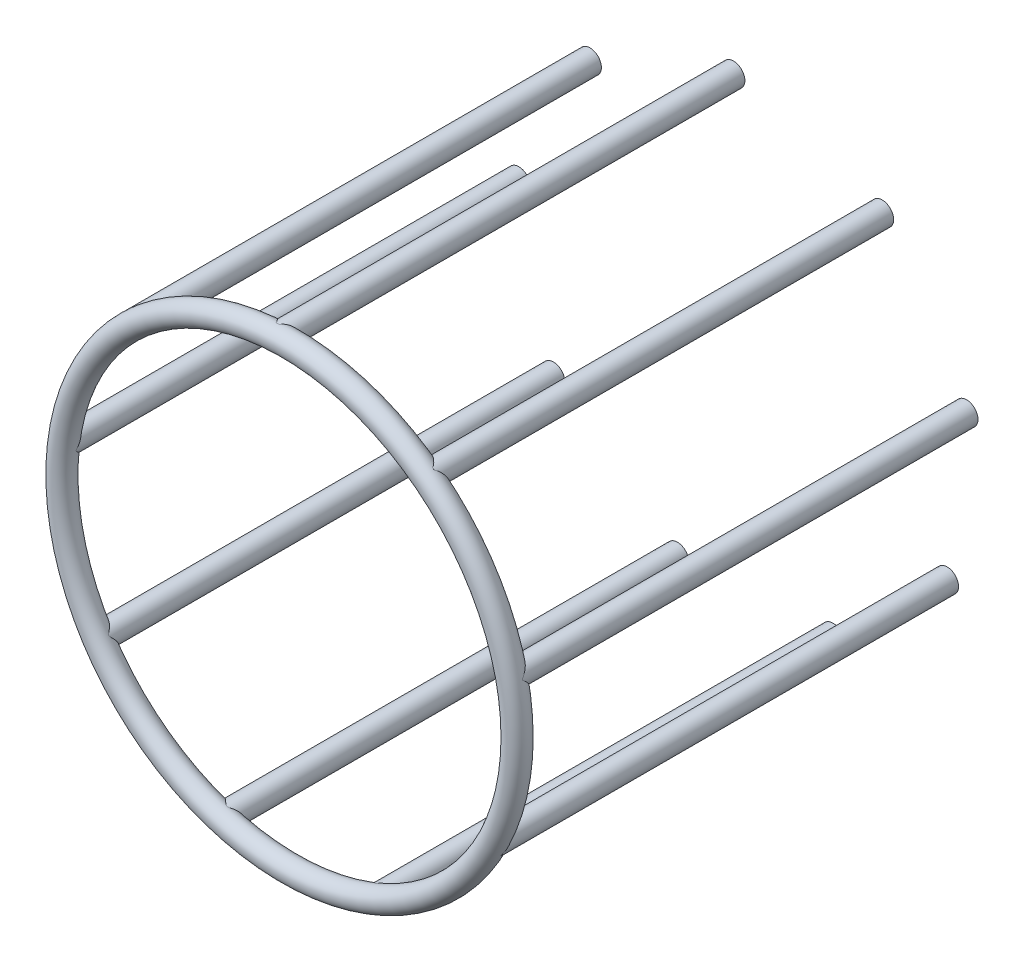
ISO-10303-21;
HEADER;
FILE_DESCRIPTION(('STEP AP214'),'2;1');
FILE_NAME('part.step','',(''),(''),'','','');
FILE_SCHEMA(('AUTOMOTIVE_DESIGN { 1 0 10303 214 1 1 1 1 }'));
ENDSEC;
DATA;
#1=APPLICATION_CONTEXT('core data for automotive mechanical design processes');
#2=APPLICATION_PROTOCOL_DEFINITION('international standard','automotive_design',2000,#1);
#3=PRODUCT_CONTEXT('',#1,'mechanical');
#4=PRODUCT('Part','Part','',(#3));
#5=PRODUCT_RELATED_PRODUCT_CATEGORY('part','',(#4));
#6=PRODUCT_DEFINITION_FORMATION('','',#4);
#7=PRODUCT_DEFINITION_CONTEXT('part definition',#1,'design');
#8=PRODUCT_DEFINITION('design','',#6,#7);
#9=PRODUCT_DEFINITION_SHAPE('','',#8);
#10=(LENGTH_UNIT() NAMED_UNIT(*) SI_UNIT(.MILLI.,.METRE.));
#11=(NAMED_UNIT(*) PLANE_ANGLE_UNIT() SI_UNIT($,.RADIAN.));
#12=(NAMED_UNIT(*) SI_UNIT($,.STERADIAN.) SOLID_ANGLE_UNIT());
#13=UNCERTAINTY_MEASURE_WITH_UNIT(LENGTH_MEASURE(1.E-05),#10,'distance_accuracy_value','');
#14=(GEOMETRIC_REPRESENTATION_CONTEXT(3) GLOBAL_UNCERTAINTY_ASSIGNED_CONTEXT((#13)) GLOBAL_UNIT_ASSIGNED_CONTEXT((#10,
#11,#12)) REPRESENTATION_CONTEXT('',''));
#15=CARTESIAN_POINT('',(0.,0.,0.));
#16=DIRECTION('',(0.,0.,1.));
#17=DIRECTION('',(1.,0.,0.));
#18=AXIS2_PLACEMENT_3D('',#15,#16,#17);
#19=CARTESIAN_POINT('',(0.,0.,100.));
#20=DIRECTION('',(0.,0.,1.));
#21=DIRECTION('',(1.,0.,0.));
#22=AXIS2_PLACEMENT_3D('',#19,#20,#21);
#23=TOROIDAL_SURFACE('',#22,50.,2.5);
#24=CARTESIAN_POINT('',(50.,0.,100.));
#25=DIRECTION('',(0.,1.,0.));
#26=DIRECTION('',(-1.,0.,0.));
#27=AXIS2_PLACEMENT_3D('',#24,#25,#26);
#28=CIRCLE('',#27,2.5);
#29=CARTESIAN_POINT('',(52.5,0.,100.));
#30=VERTEX_POINT('',#29);
#31=EDGE_CURVE('E12',#30,#30,#28,.T.);
#32=CARTESIAN_POINT('',(0.,0.,100.));
#33=DIRECTION('',(0.,0.,1.));
#34=DIRECTION('',(1.,0.,0.));
#35=AXIS2_PLACEMENT_3D('',#32,#33,#34);
#36=CIRCLE('',#35,52.5);
#37=EDGE_CURVE('',#30,#30,#36,.T.);
#38=ORIENTED_EDGE('',*,*,#31,.T.);
#39=ORIENTED_EDGE('',*,*,#31,.F.);
#40=ORIENTED_EDGE('',*,*,#37,.T.);
#41=ORIENTED_EDGE('',*,*,#37,.F.);
#42=EDGE_LOOP('',(#38,#40,#39,#41));
#43=FACE_BOUND('',#42,.T.);
#44=ADVANCED_FACE('F56',(#43),#23,.T.);
#45=CLOSED_SHELL('',(#44));
#46=MANIFOLD_SOLID_BREP('B2',#45);
#47=CARTESIAN_POINT('',(-49.6078099092593,6.2502156768226,100.));
#48=DIRECTION('',(0.,0.,-1.));
#49=DIRECTION('',(-1.,0.,0.));
#50=AXIS2_PLACEMENT_3D('',#47,#48,#49);
#51=CYLINDRICAL_SURFACE('',#50,2.5);
#52=CARTESIAN_POINT('',(-49.6078099092593,6.2502156768226,100.));
#53=DIRECTION('',(0.,0.,1.));
#54=DIRECTION('',(1.,0.,0.));
#55=AXIS2_PLACEMENT_3D('',#52,#53,#54);
#56=CIRCLE('',#55,2.5);
#57=CARTESIAN_POINT('',(-47.1078099092593,6.2502156768226,100.));
#58=VERTEX_POINT('',#57);
#59=EDGE_CURVE('E55',#58,#58,#56,.T.);
#60=ORIENTED_EDGE('',*,*,#59,.F.);
#61=EDGE_LOOP('',(#60));
#62=FACE_BOUND('',#61,.T.);
#63=CARTESIAN_POINT('',(-49.6078099092593,6.2502156768226,0.));
#64=DIRECTION('',(0.,0.,1.));
#65=DIRECTION('',(1.,0.,0.));
#66=AXIS2_PLACEMENT_3D('',#63,#64,#65);
#67=CIRCLE('',#66,2.5);
#68=CARTESIAN_POINT('',(-47.1078099092593,6.2502156768226,0.));
#69=VERTEX_POINT('',#68);
#70=EDGE_CURVE('E85',#69,#69,#67,.T.);
#71=ORIENTED_EDGE('',*,*,#70,.T.);
#72=EDGE_LOOP('',(#71));
#73=FACE_BOUND('',#72,.T.);
#74=ADVANCED_FACE('F82',(#62,#73),#51,.T.);
#75=CARTESIAN_POINT('',(-49.6078099092593,6.2502156768226,100.));
#76=DIRECTION('',(0.,0.,1.));
#77=DIRECTION('',(1.,0.,0.));
#78=AXIS2_PLACEMENT_3D('',#75,#76,#77);
#79=PLANE('',#78);
#80=ORIENTED_EDGE('',*,*,#59,.T.);
#81=EDGE_LOOP('',(#80));
#82=FACE_BOUND('',#81,.T.);
#83=ADVANCED_FACE('F97',(#82),#79,.T.);
#84=CARTESIAN_POINT('',(-49.6078099092593,6.2502156768226,0.));
#85=DIRECTION('',(0.,0.,1.));
#86=DIRECTION('',(1.,0.,0.));
#87=AXIS2_PLACEMENT_3D('',#84,#85,#86);
#88=PLANE('',#87);
#89=ORIENTED_EDGE('',*,*,#70,.F.);
#90=EDGE_LOOP('',(#89));
#91=FACE_BOUND('',#90,.T.);
#92=ADVANCED_FACE('F95',(#91),#88,.F.);
#93=CLOSED_SHELL('',(#74,#83,#92));
#94=MANIFOLD_SOLID_BREP('B7',#93);
#95=CARTESIAN_POINT('',(-33.9842259213605,36.6752285408821,100.));
#96=DIRECTION('',(0.,0.,-1.));
#97=DIRECTION('',(-1.,0.,0.));
#98=AXIS2_PLACEMENT_3D('',#95,#96,#97);
#99=CYLINDRICAL_SURFACE('',#98,2.5);
#100=CARTESIAN_POINT('',(-33.9842259213605,36.6752285408821,100.));
#101=DIRECTION('',(0.,0.,1.));
#102=DIRECTION('',(1.,0.,0.));
#103=AXIS2_PLACEMENT_3D('',#100,#101,#102);
#104=CIRCLE('',#103,2.5);
#105=CARTESIAN_POINT('',(-31.4842259213605,36.6752285408821,100.));
#106=VERTEX_POINT('',#105);
#107=EDGE_CURVE('E81',#106,#106,#104,.T.);
#108=ORIENTED_EDGE('',*,*,#107,.F.);
#109=EDGE_LOOP('',(#108));
#110=FACE_BOUND('',#109,.T.);
#111=CARTESIAN_POINT('',(-33.9842259213605,36.6752285408821,0.));
#112=DIRECTION('',(0.,0.,1.));
#113=DIRECTION('',(1.,0.,0.));
#114=AXIS2_PLACEMENT_3D('',#111,#112,#113);
#115=CIRCLE('',#114,2.5);
#116=CARTESIAN_POINT('',(-31.4842259213605,36.6752285408821,0.));
#117=VERTEX_POINT('',#116);
#118=EDGE_CURVE('E134',#117,#117,#115,.T.);
#119=ORIENTED_EDGE('',*,*,#118,.T.);
#120=EDGE_LOOP('',(#119));
#121=FACE_BOUND('',#120,.T.);
#122=ADVANCED_FACE('F131',(#110,#121),#99,.T.);
#123=CARTESIAN_POINT('',(-33.9842259213605,36.6752285408821,100.));
#124=DIRECTION('',(0.,0.,1.));
#125=DIRECTION('',(1.,0.,0.));
#126=AXIS2_PLACEMENT_3D('',#123,#124,#125);
#127=PLANE('',#126);
#128=ORIENTED_EDGE('',*,*,#107,.T.);
#129=EDGE_LOOP('',(#128));
#130=FACE_BOUND('',#129,.T.);
#131=ADVANCED_FACE('F146',(#130),#127,.T.);
#132=CARTESIAN_POINT('',(-33.9842259213605,36.6752285408821,0.));
#133=DIRECTION('',(0.,0.,1.));
#134=DIRECTION('',(1.,0.,0.));
#135=AXIS2_PLACEMENT_3D('',#132,#133,#134);
#136=PLANE('',#135);
#137=ORIENTED_EDGE('',*,*,#118,.F.);
#138=EDGE_LOOP('',(#137));
#139=FACE_BOUND('',#138,.T.);
#140=ADVANCED_FACE('F144',(#139),#136,.F.);
#141=CLOSED_SHELL('',(#122,#131,#140));
#142=MANIFOLD_SOLID_BREP('B50',#141);
#143=CARTESIAN_POINT('',(-2.45904493225702,49.9394943708999,100.));
#144=DIRECTION('',(0.,0.,-1.));
#145=DIRECTION('',(-1.,0.,0.));
#146=AXIS2_PLACEMENT_3D('',#143,#144,#145);
#147=CYLINDRICAL_SURFACE('',#146,2.5);
#148=CARTESIAN_POINT('',(-2.45904493225702,49.9394943708999,100.));
#149=DIRECTION('',(0.,0.,1.));
#150=DIRECTION('',(1.,0.,0.));
#151=AXIS2_PLACEMENT_3D('',#148,#149,#150);
#152=CIRCLE('',#151,2.5);
#153=CARTESIAN_POINT('',(0.040955067742978,49.9394943708999,100.));
#154=VERTEX_POINT('',#153);
#155=EDGE_CURVE('E130',#154,#154,#152,.T.);
#156=ORIENTED_EDGE('',*,*,#155,.F.);
#157=EDGE_LOOP('',(#156));
#158=FACE_BOUND('',#157,.T.);
#159=CARTESIAN_POINT('',(-2.45904493225702,49.9394943708999,0.));
#160=DIRECTION('',(0.,0.,1.));
#161=DIRECTION('',(1.,0.,0.));
#162=AXIS2_PLACEMENT_3D('',#159,#160,#161);
#163=CIRCLE('',#162,2.5);
#164=CARTESIAN_POINT('',(0.040955067742978,49.9394943708999,0.));
#165=VERTEX_POINT('',#164);
#166=EDGE_CURVE('E183',#165,#165,#163,.T.);
#167=ORIENTED_EDGE('',*,*,#166,.T.);
#168=EDGE_LOOP('',(#167));
#169=FACE_BOUND('',#168,.T.);
#170=ADVANCED_FACE('F180',(#158,#169),#147,.T.);
#171=CARTESIAN_POINT('',(-2.45904493225702,49.9394943708999,100.));
#172=DIRECTION('',(0.,0.,1.));
#173=DIRECTION('',(1.,0.,0.));
#174=AXIS2_PLACEMENT_3D('',#171,#172,#173);
#175=PLANE('',#174);
#176=ORIENTED_EDGE('',*,*,#155,.T.);
#177=EDGE_LOOP('',(#176));
#178=FACE_BOUND('',#177,.T.);
#179=ADVANCED_FACE('F195',(#178),#175,.T.);
#180=CARTESIAN_POINT('',(-2.45904493225702,49.9394943708999,0.));
#181=DIRECTION('',(0.,0.,1.));
#182=DIRECTION('',(1.,0.,0.));
#183=AXIS2_PLACEMENT_3D('',#180,#181,#182);
#184=PLANE('',#183);
#185=ORIENTED_EDGE('',*,*,#166,.F.);
#186=EDGE_LOOP('',(#185));
#187=FACE_BOUND('',#186,.T.);
#188=ADVANCED_FACE('F193',(#187),#184,.F.);
#189=CLOSED_SHELL('',(#170,#179,#188));
#190=MANIFOLD_SOLID_BREP('B76',#189);
#191=CARTESIAN_POINT('',(30.2167505098897,39.8365157691166,100.));
#192=DIRECTION('',(0.,0.,-1.));
#193=DIRECTION('',(-1.,0.,0.));
#194=AXIS2_PLACEMENT_3D('',#191,#192,#193);
#195=CYLINDRICAL_SURFACE('',#194,2.5);
#196=CARTESIAN_POINT('',(30.2167505098897,39.8365157691166,100.));
#197=DIRECTION('',(0.,0.,1.));
#198=DIRECTION('',(1.,0.,0.));
#199=AXIS2_PLACEMENT_3D('',#196,#197,#198);
#200=CIRCLE('',#199,2.5);
#201=CARTESIAN_POINT('',(32.7167505098897,39.8365157691166,100.));
#202=VERTEX_POINT('',#201);
#203=EDGE_CURVE('E179',#202,#202,#200,.T.);
#204=ORIENTED_EDGE('',*,*,#203,.F.);
#205=EDGE_LOOP('',(#204));
#206=FACE_BOUND('',#205,.T.);
#207=CARTESIAN_POINT('',(30.2167505098897,39.8365157691166,0.));
#208=DIRECTION('',(0.,0.,1.));
#209=DIRECTION('',(1.,0.,0.));
#210=AXIS2_PLACEMENT_3D('',#207,#208,#209);
#211=CIRCLE('',#210,2.5);
#212=CARTESIAN_POINT('',(32.7167505098897,39.8365157691166,0.));
#213=VERTEX_POINT('',#212);
#214=EDGE_CURVE('E232',#213,#213,#211,.T.);
#215=ORIENTED_EDGE('',*,*,#214,.T.);
#216=EDGE_LOOP('',(#215));
#217=FACE_BOUND('',#216,.T.);
#218=ADVANCED_FACE('F229',(#206,#217),#195,.T.);
#219=CARTESIAN_POINT('',(30.2167505098897,39.8365157691166,100.));
#220=DIRECTION('',(0.,0.,1.));
#221=DIRECTION('',(1.,0.,0.));
#222=AXIS2_PLACEMENT_3D('',#219,#220,#221);
#223=PLANE('',#222);
#224=ORIENTED_EDGE('',*,*,#203,.T.);
#225=EDGE_LOOP('',(#224));
#226=FACE_BOUND('',#225,.T.);
#227=ADVANCED_FACE('F244',(#226),#223,.T.);
#228=CARTESIAN_POINT('',(30.2167505098897,39.8365157691166,0.));
#229=DIRECTION('',(0.,0.,1.));
#230=DIRECTION('',(1.,0.,0.));
#231=AXIS2_PLACEMENT_3D('',#228,#229,#230);
#232=PLANE('',#231);
#233=ORIENTED_EDGE('',*,*,#214,.F.);
#234=EDGE_LOOP('',(#233));
#235=FACE_BOUND('',#234,.T.);
#236=ADVANCED_FACE('F242',(#235),#232,.F.);
#237=CLOSED_SHELL('',(#218,#227,#236));
#238=MANIFOLD_SOLID_BREP('B125',#237);
#239=CARTESIAN_POINT('',(48.7537925666842,11.0935887054068,100.));
#240=DIRECTION('',(0.,0.,-1.));
#241=DIRECTION('',(-1.,0.,0.));
#242=AXIS2_PLACEMENT_3D('',#239,#240,#241);
#243=CYLINDRICAL_SURFACE('',#242,2.5);
#244=CARTESIAN_POINT('',(48.7537925666842,11.0935887054068,100.));
#245=DIRECTION('',(0.,0.,1.));
#246=DIRECTION('',(1.,0.,0.));
#247=AXIS2_PLACEMENT_3D('',#244,#245,#246);
#248=CIRCLE('',#247,2.5);
#249=CARTESIAN_POINT('',(51.2537925666842,11.0935887054068,100.));
#250=VERTEX_POINT('',#249);
#251=EDGE_CURVE('E228',#250,#250,#248,.T.);
#252=ORIENTED_EDGE('',*,*,#251,.F.);
#253=EDGE_LOOP('',(#252));
#254=FACE_BOUND('',#253,.T.);
#255=CARTESIAN_POINT('',(48.7537925666842,11.0935887054068,0.));
#256=DIRECTION('',(0.,0.,1.));
#257=DIRECTION('',(1.,0.,0.));
#258=AXIS2_PLACEMENT_3D('',#255,#256,#257);
#259=CIRCLE('',#258,2.5);
#260=CARTESIAN_POINT('',(51.2537925666842,11.0935887054068,0.));
#261=VERTEX_POINT('',#260);
#262=EDGE_CURVE('E281',#261,#261,#259,.T.);
#263=ORIENTED_EDGE('',*,*,#262,.T.);
#264=EDGE_LOOP('',(#263));
#265=FACE_BOUND('',#264,.T.);
#266=ADVANCED_FACE('F278',(#254,#265),#243,.T.);
#267=CARTESIAN_POINT('',(48.7537925666842,11.0935887054068,100.));
#268=DIRECTION('',(0.,0.,1.));
#269=DIRECTION('',(1.,0.,0.));
#270=AXIS2_PLACEMENT_3D('',#267,#268,#269);
#271=PLANE('',#270);
#272=ORIENTED_EDGE('',*,*,#251,.T.);
#273=EDGE_LOOP('',(#272));
#274=FACE_BOUND('',#273,.T.);
#275=ADVANCED_FACE('F293',(#274),#271,.T.);
#276=CARTESIAN_POINT('',(48.7537925666842,11.0935887054068,0.));
#277=DIRECTION('',(0.,0.,1.));
#278=DIRECTION('',(1.,0.,0.));
#279=AXIS2_PLACEMENT_3D('',#276,#277,#278);
#280=PLANE('',#279);
#281=ORIENTED_EDGE('',*,*,#262,.F.);
#282=EDGE_LOOP('',(#281));
#283=FACE_BOUND('',#282,.T.);
#284=ADVANCED_FACE('F291',(#283),#280,.F.);
#285=CLOSED_SHELL('',(#266,#275,#284));
#286=MANIFOLD_SOLID_BREP('B174',#285);
#287=CARTESIAN_POINT('',(44.4783932434778,-22.840151805068,100.));
#288=DIRECTION('',(0.,0.,-1.));
#289=DIRECTION('',(-1.,0.,0.));
#290=AXIS2_PLACEMENT_3D('',#287,#288,#289);
#291=CYLINDRICAL_SURFACE('',#290,2.5);
#292=CARTESIAN_POINT('',(44.4783932434778,-22.840151805068,100.));
#293=DIRECTION('',(0.,0.,1.));
#294=DIRECTION('',(1.,0.,0.));
#295=AXIS2_PLACEMENT_3D('',#292,#293,#294);
#296=CIRCLE('',#295,2.5);
#297=CARTESIAN_POINT('',(46.9783932434778,-22.840151805068,100.));
#298=VERTEX_POINT('',#297);
#299=EDGE_CURVE('E277',#298,#298,#296,.T.);
#300=ORIENTED_EDGE('',*,*,#299,.F.);
#301=EDGE_LOOP('',(#300));
#302=FACE_BOUND('',#301,.T.);
#303=CARTESIAN_POINT('',(44.4783932434778,-22.840151805068,0.));
#304=DIRECTION('',(0.,0.,1.));
#305=DIRECTION('',(1.,0.,0.));
#306=AXIS2_PLACEMENT_3D('',#303,#304,#305);
#307=CIRCLE('',#306,2.5);
#308=CARTESIAN_POINT('',(46.9783932434778,-22.840151805068,0.));
#309=VERTEX_POINT('',#308);
#310=EDGE_CURVE('E330',#309,#309,#307,.T.);
#311=ORIENTED_EDGE('',*,*,#310,.T.);
#312=EDGE_LOOP('',(#311));
#313=FACE_BOUND('',#312,.T.);
#314=ADVANCED_FACE('F327',(#302,#313),#291,.T.);
#315=CARTESIAN_POINT('',(44.4783932434778,-22.840151805068,100.));
#316=DIRECTION('',(0.,0.,1.));
#317=DIRECTION('',(1.,0.,0.));
#318=AXIS2_PLACEMENT_3D('',#315,#316,#317);
#319=PLANE('',#318);
#320=ORIENTED_EDGE('',*,*,#299,.T.);
#321=EDGE_LOOP('',(#320));
#322=FACE_BOUND('',#321,.T.);
#323=ADVANCED_FACE('F342',(#322),#319,.T.);
#324=CARTESIAN_POINT('',(44.4783932434778,-22.840151805068,0.));
#325=DIRECTION('',(0.,0.,1.));
#326=DIRECTION('',(1.,0.,0.));
#327=AXIS2_PLACEMENT_3D('',#324,#325,#326);
#328=PLANE('',#327);
#329=ORIENTED_EDGE('',*,*,#310,.F.);
#330=EDGE_LOOP('',(#329));
#331=FACE_BOUND('',#330,.T.);
#332=ADVANCED_FACE('F340',(#331),#328,.F.);
#333=CLOSED_SHELL('',(#314,#323,#332));
#334=MANIFOLD_SOLID_BREP('B223',#333);
#335=CARTESIAN_POINT('',(19.3910593993695,-46.0867314459392,100.));
#336=DIRECTION('',(0.,0.,-1.));
#337=DIRECTION('',(-1.,0.,0.));
#338=AXIS2_PLACEMENT_3D('',#335,#336,#337);
#339=CYLINDRICAL_SURFACE('',#338,2.5);
#340=CARTESIAN_POINT('',(19.3910593993695,-46.0867314459392,100.));
#341=DIRECTION('',(0.,0.,1.));
#342=DIRECTION('',(1.,0.,0.));
#343=AXIS2_PLACEMENT_3D('',#340,#341,#342);
#344=CIRCLE('',#343,2.5);
#345=CARTESIAN_POINT('',(21.8910593993695,-46.0867314459392,100.));
#346=VERTEX_POINT('',#345);
#347=EDGE_CURVE('E326',#346,#346,#344,.T.);
#348=ORIENTED_EDGE('',*,*,#347,.F.);
#349=EDGE_LOOP('',(#348));
#350=FACE_BOUND('',#349,.T.);
#351=CARTESIAN_POINT('',(19.3910593993695,-46.0867314459392,0.));
#352=DIRECTION('',(0.,0.,1.));
#353=DIRECTION('',(1.,0.,0.));
#354=AXIS2_PLACEMENT_3D('',#351,#352,#353);
#355=CIRCLE('',#354,2.5);
#356=CARTESIAN_POINT('',(21.8910593993695,-46.0867314459392,0.));
#357=VERTEX_POINT('',#356);
#358=EDGE_CURVE('E379',#357,#357,#355,.T.);
#359=ORIENTED_EDGE('',*,*,#358,.T.);
#360=EDGE_LOOP('',(#359));
#361=FACE_BOUND('',#360,.T.);
#362=ADVANCED_FACE('F376',(#350,#361),#339,.T.);
#363=CARTESIAN_POINT('',(19.3910593993695,-46.0867314459392,100.));
#364=DIRECTION('',(0.,0.,1.));
#365=DIRECTION('',(1.,0.,0.));
#366=AXIS2_PLACEMENT_3D('',#363,#364,#365);
#367=PLANE('',#366);
#368=ORIENTED_EDGE('',*,*,#347,.T.);
#369=EDGE_LOOP('',(#368));
#370=FACE_BOUND('',#369,.T.);
#371=ADVANCED_FACE('F392',(#370),#367,.T.);
#372=CARTESIAN_POINT('',(19.3910593993695,-46.0867314459392,0.));
#373=DIRECTION('',(0.,0.,1.));
#374=DIRECTION('',(1.,0.,0.));
#375=AXIS2_PLACEMENT_3D('',#372,#373,#374);
#376=PLANE('',#375);
#377=ORIENTED_EDGE('',*,*,#358,.F.);
#378=EDGE_LOOP('',(#377));
#379=FACE_BOUND('',#378,.T.);
#380=ADVANCED_FACE('F390',(#379),#376,.F.);
#381=CLOSED_SHELL('',(#362,#371,#380));
#382=MANIFOLD_SOLID_BREP('B272',#381);
#383=CARTESIAN_POINT('',(-14.7695666453237,-47.7688172462888,100.));
#384=DIRECTION('',(0.,0.,-1.));
#385=DIRECTION('',(-1.,0.,0.));
#386=AXIS2_PLACEMENT_3D('',#383,#384,#385);
#387=CYLINDRICAL_SURFACE('',#386,2.5);
#388=CARTESIAN_POINT('',(-14.7695666453237,-47.7688172462888,100.));
#389=DIRECTION('',(0.,0.,1.));
#390=DIRECTION('',(1.,0.,0.));
#391=AXIS2_PLACEMENT_3D('',#388,#389,#390);
#392=CIRCLE('',#391,2.5);
#393=CARTESIAN_POINT('',(-12.2695666453237,-47.7688172462888,100.));
#394=VERTEX_POINT('',#393);
#395=EDGE_CURVE('E375',#394,#394,#392,.T.);
#396=ORIENTED_EDGE('',*,*,#395,.F.);
#397=EDGE_LOOP('',(#396));
#398=FACE_BOUND('',#397,.T.);
#399=CARTESIAN_POINT('',(-14.7695666453237,-47.7688172462888,0.));
#400=DIRECTION('',(0.,0.,1.));
#401=DIRECTION('',(1.,0.,0.));
#402=AXIS2_PLACEMENT_3D('',#399,#400,#401);
#403=CIRCLE('',#402,2.5);
#404=CARTESIAN_POINT('',(-12.2695666453237,-47.7688172462888,0.));
#405=VERTEX_POINT('',#404);
#406=EDGE_CURVE('E428',#405,#405,#403,.T.);
#407=ORIENTED_EDGE('',*,*,#406,.T.);
#408=EDGE_LOOP('',(#407));
#409=FACE_BOUND('',#408,.T.);
#410=ADVANCED_FACE('F425',(#398,#409),#387,.T.);
#411=CARTESIAN_POINT('',(-14.7695666453237,-47.7688172462888,100.));
#412=DIRECTION('',(0.,0.,1.));
#413=DIRECTION('',(1.,0.,0.));
#414=AXIS2_PLACEMENT_3D('',#411,#412,#413);
#415=PLANE('',#414);
#416=ORIENTED_EDGE('',*,*,#395,.T.);
#417=EDGE_LOOP('',(#416));
#418=FACE_BOUND('',#417,.T.);
#419=ADVANCED_FACE('F440',(#418),#415,.T.);
#420=CARTESIAN_POINT('',(-14.7695666453237,-47.7688172462888,0.));
#421=DIRECTION('',(0.,0.,1.));
#422=DIRECTION('',(1.,0.,0.));
#423=AXIS2_PLACEMENT_3D('',#420,#421,#422);
#424=PLANE('',#423);
#425=ORIENTED_EDGE('',*,*,#406,.F.);
#426=EDGE_LOOP('',(#425));
#427=FACE_BOUND('',#426,.T.);
#428=ADVANCED_FACE('F438',(#427),#424,.F.);
#429=CLOSED_SHELL('',(#410,#419,#428));
#430=MANIFOLD_SOLID_BREP('B321',#429);
#431=CARTESIAN_POINT('',(-42.0193483112208,-27.0993425658319,100.));
#432=DIRECTION('',(0.,0.,-1.));
#433=DIRECTION('',(-1.,0.,0.));
#434=AXIS2_PLACEMENT_3D('',#431,#432,#433);
#435=CYLINDRICAL_SURFACE('',#434,2.5);
#436=CARTESIAN_POINT('',(-42.0193483112208,-27.0993425658319,100.));
#437=DIRECTION('',(0.,0.,1.));
#438=DIRECTION('',(1.,0.,0.));
#439=AXIS2_PLACEMENT_3D('',#436,#437,#438);
#440=CIRCLE('',#439,2.5);
#441=CARTESIAN_POINT('',(-39.5193483112208,-27.0993425658319,100.));
#442=VERTEX_POINT('',#441);
#443=EDGE_CURVE('E424',#442,#442,#440,.T.);
#444=ORIENTED_EDGE('',*,*,#443,.F.);
#445=EDGE_LOOP('',(#444));
#446=FACE_BOUND('',#445,.T.);
#447=CARTESIAN_POINT('',(-42.0193483112208,-27.0993425658319,0.));
#448=DIRECTION('',(0.,0.,1.));
#449=DIRECTION('',(1.,0.,0.));
#450=AXIS2_PLACEMENT_3D('',#447,#448,#449);
#451=CIRCLE('',#450,2.5);
#452=CARTESIAN_POINT('',(-39.5193483112208,-27.0993425658319,0.));
#453=VERTEX_POINT('',#452);
#454=EDGE_CURVE('E469',#453,#453,#451,.T.);
#455=ORIENTED_EDGE('',*,*,#454,.T.);
#456=EDGE_LOOP('',(#455));
#457=FACE_BOUND('',#456,.T.);
#458=ADVANCED_FACE('F466',(#446,#457),#435,.T.);
#459=CARTESIAN_POINT('',(-42.0193483112208,-27.0993425658319,100.));
#460=DIRECTION('',(0.,0.,1.));
#461=DIRECTION('',(1.,0.,0.));
#462=AXIS2_PLACEMENT_3D('',#459,#460,#461);
#463=PLANE('',#462);
#464=ORIENTED_EDGE('',*,*,#443,.T.);
#465=EDGE_LOOP('',(#464));
#466=FACE_BOUND('',#465,.T.);
#467=ADVANCED_FACE('F481',(#466),#463,.T.);
#468=CARTESIAN_POINT('',(-42.0193483112208,-27.0993425658319,0.));
#469=DIRECTION('',(0.,0.,1.));
#470=DIRECTION('',(1.,0.,0.));
#471=AXIS2_PLACEMENT_3D('',#468,#469,#470);
#472=PLANE('',#471);
#473=ORIENTED_EDGE('',*,*,#454,.F.);
#474=EDGE_LOOP('',(#473));
#475=FACE_BOUND('',#474,.T.);
#476=ADVANCED_FACE('F479',(#475),#472,.F.);
#477=CLOSED_SHELL('',(#458,#467,#476));
#478=MANIFOLD_SOLID_BREP('B370',#477);
#479=ADVANCED_BREP_SHAPE_REPRESENTATION('',(#18,#46,#94,#142,#190,#238,#286,#334,#382,#430,
#478),#14);
#480=SHAPE_DEFINITION_REPRESENTATION(#9,#479);
ENDSEC;
END-ISO-10303-21;
